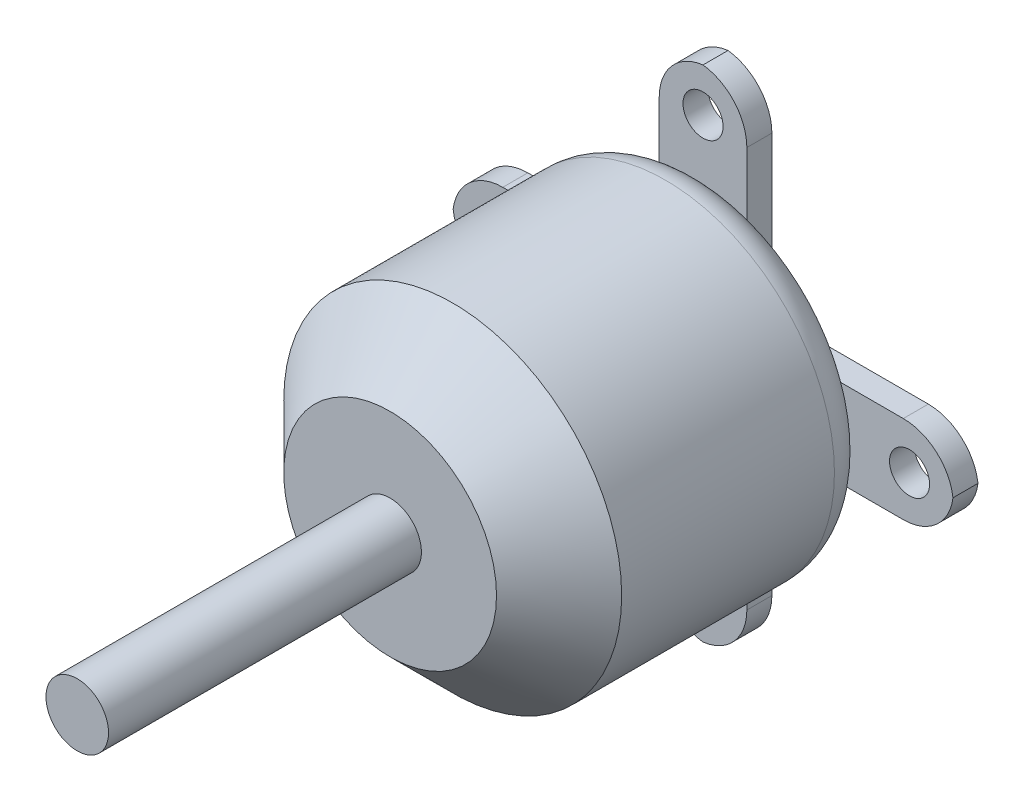
ISO-10303-21;
HEADER;
FILE_DESCRIPTION(('STEP AP214'),'2;1');
FILE_NAME('part.step','',(''),(''),'','','');
FILE_SCHEMA(('AUTOMOTIVE_DESIGN { 1 0 10303 214 1 1 1 1 }'));
ENDSEC;
DATA;
#1=APPLICATION_CONTEXT('core data for automotive mechanical design processes');
#2=APPLICATION_PROTOCOL_DEFINITION('international standard','automotive_design',2000,#1);
#3=PRODUCT_CONTEXT('',#1,'mechanical');
#4=PRODUCT('Part','Part','',(#3));
#5=PRODUCT_RELATED_PRODUCT_CATEGORY('part','',(#4));
#6=PRODUCT_DEFINITION_FORMATION('','',#4);
#7=PRODUCT_DEFINITION_CONTEXT('part definition',#1,'design');
#8=PRODUCT_DEFINITION('design','',#6,#7);
#9=PRODUCT_DEFINITION_SHAPE('','',#8);
#10=(LENGTH_UNIT() NAMED_UNIT(*) SI_UNIT(.MILLI.,.METRE.));
#11=(NAMED_UNIT(*) PLANE_ANGLE_UNIT() SI_UNIT($,.RADIAN.));
#12=(NAMED_UNIT(*) SI_UNIT($,.STERADIAN.) SOLID_ANGLE_UNIT());
#13=UNCERTAINTY_MEASURE_WITH_UNIT(LENGTH_MEASURE(1.E-05),#10,'distance_accuracy_value','');
#14=(GEOMETRIC_REPRESENTATION_CONTEXT(3) GLOBAL_UNCERTAINTY_ASSIGNED_CONTEXT((#13)) GLOBAL_UNIT_ASSIGNED_CONTEXT((#10,
#11,#12)) REPRESENTATION_CONTEXT('',''));
#15=CARTESIAN_POINT('',(0.,0.,0.));
#16=DIRECTION('',(0.,0.,1.));
#17=DIRECTION('',(1.,0.,0.));
#18=AXIS2_PLACEMENT_3D('',#15,#16,#17);
#19=CARTESIAN_POINT('',(0.,0.,0.));
#20=DIRECTION('',(0.,0.,1.));
#21=DIRECTION('',(1.,0.,0.));
#22=AXIS2_PLACEMENT_3D('',#19,#20,#21);
#23=PLANE('',#22);
#24=DIRECTION('',(0.,-1.,0.));
#25=VECTOR('',#24,1.);
#26=CARTESIAN_POINT('',(3.5,16.,0.));
#27=LINE('',#26,#25);
#28=CARTESIAN_POINT('',(3.5,9.89949493661167,0.));
#29=VERTEX_POINT('',#28);
#30=CARTESIAN_POINT('',(3.5,7.5,0.));
#31=VERTEX_POINT('',#30);
#32=EDGE_CURVE('E305',#29,#31,#27,.T.);
#33=ORIENTED_EDGE('',*,*,#32,.F.);
#34=CARTESIAN_POINT('',(0.,0.,0.));
#35=DIRECTION('',(0.,0.,1.));
#36=DIRECTION('',(1.,0.,0.));
#37=AXIS2_PLACEMENT_3D('',#34,#35,#36);
#38=CIRCLE('',#37,10.5);
#39=CARTESIAN_POINT('',(9.89949493661166,3.5,0.));
#40=VERTEX_POINT('',#39);
#41=EDGE_CURVE('E818',#29,#40,#38,.F.);
#42=ORIENTED_EDGE('',*,*,#41,.T.);
#43=DIRECTION('',(1.,0.,0.));
#44=VECTOR('',#43,1.);
#45=CARTESIAN_POINT('',(16.,3.5,0.));
#46=LINE('',#45,#44);
#47=CARTESIAN_POINT('',(7.5,3.5,0.));
#48=VERTEX_POINT('',#47);
#49=EDGE_CURVE('E55',#48,#40,#46,.T.);
#50=ORIENTED_EDGE('',*,*,#49,.F.);
#51=CARTESIAN_POINT('',(7.5,7.5,0.));
#52=DIRECTION('',(0.,0.,1.));
#53=DIRECTION('',(1.,0.,0.));
#54=AXIS2_PLACEMENT_3D('',#51,#52,#53);
#55=CIRCLE('',#54,4.);
#56=EDGE_CURVE('E50',#31,#48,#55,.T.);
#57=ORIENTED_EDGE('',*,*,#56,.F.);
#58=EDGE_LOOP('',(#33,#42,#50,#57));
#59=FACE_BOUND('',#58,.T.);
#60=ADVANCED_FACE('F34',(#59),#23,.F.);
#61=DIRECTION('',(-1.,0.,0.));
#62=VECTOR('',#61,1.);
#63=CARTESIAN_POINT('',(16.,-3.5,0.));
#64=LINE('',#63,#62);
#65=CARTESIAN_POINT('',(9.89949493661044,-3.5,0.));
#66=VERTEX_POINT('',#65);
#67=CARTESIAN_POINT('',(7.5,-3.5,0.));
#68=VERTEX_POINT('',#67);
#69=EDGE_CURVE('E320',#66,#68,#64,.T.);
#70=ORIENTED_EDGE('',*,*,#69,.F.);
#71=CARTESIAN_POINT('',(3.5,-9.89949493661166,0.));
#72=VERTEX_POINT('',#71);
#73=EDGE_CURVE('E241',#66,#72,#38,.F.);
#74=ORIENTED_EDGE('',*,*,#73,.T.);
#75=DIRECTION('',(0.,-1.,0.));
#76=VECTOR('',#75,1.);
#77=CARTESIAN_POINT('',(3.5,-7.5,0.));
#78=LINE('',#77,#76);
#79=CARTESIAN_POINT('',(3.5,-7.5,0.));
#80=VERTEX_POINT('',#79);
#81=EDGE_CURVE('E329',#80,#72,#78,.T.);
#82=ORIENTED_EDGE('',*,*,#81,.F.);
#83=CARTESIAN_POINT('',(7.5,-7.5,0.));
#84=DIRECTION('',(0.,0.,1.));
#85=DIRECTION('',(-1.,0.,0.));
#86=AXIS2_PLACEMENT_3D('',#83,#84,#85);
#87=CIRCLE('',#86,4.);
#88=EDGE_CURVE('E324',#68,#80,#87,.T.);
#89=ORIENTED_EDGE('',*,*,#88,.F.);
#90=EDGE_LOOP('',(#70,#74,#82,#89));
#91=FACE_BOUND('',#90,.T.);
#92=ADVANCED_FACE('F269',(#91),#23,.F.);
#93=DIRECTION('',(0.,1.,0.));
#94=VECTOR('',#93,1.);
#95=CARTESIAN_POINT('',(-3.5,-7.5,0.));
#96=LINE('',#95,#94);
#97=CARTESIAN_POINT('',(-3.5,-9.89949493661166,0.));
#98=VERTEX_POINT('',#97);
#99=CARTESIAN_POINT('',(-3.5,-7.5,0.));
#100=VERTEX_POINT('',#99);
#101=EDGE_CURVE('E338',#98,#100,#96,.T.);
#102=ORIENTED_EDGE('',*,*,#101,.F.);
#103=CARTESIAN_POINT('',(-9.89949493661167,-3.5,0.));
#104=VERTEX_POINT('',#103);
#105=EDGE_CURVE('E821',#98,#104,#38,.F.);
#106=ORIENTED_EDGE('',*,*,#105,.T.);
#107=DIRECTION('',(-1.,0.,0.));
#108=VECTOR('',#107,1.);
#109=CARTESIAN_POINT('',(-7.5,-3.5,0.));
#110=LINE('',#109,#108);
#111=CARTESIAN_POINT('',(-7.5,-3.5,0.));
#112=VERTEX_POINT('',#111);
#113=EDGE_CURVE('E347',#112,#104,#110,.T.);
#114=ORIENTED_EDGE('',*,*,#113,.F.);
#115=CARTESIAN_POINT('',(-7.5,-7.5,0.));
#116=DIRECTION('',(0.,0.,1.));
#117=DIRECTION('',(1.,0.,0.));
#118=AXIS2_PLACEMENT_3D('',#115,#116,#117);
#119=CIRCLE('',#118,4.);
#120=EDGE_CURVE('E343',#100,#112,#119,.T.);
#121=ORIENTED_EDGE('',*,*,#120,.F.);
#122=EDGE_LOOP('',(#102,#106,#114,#121));
#123=FACE_BOUND('',#122,.T.);
#124=ADVANCED_FACE('F275',(#123),#23,.F.);
#125=DIRECTION('',(0.,1.,0.));
#126=VECTOR('',#125,1.);
#127=CARTESIAN_POINT('',(-3.5,16.,0.));
#128=LINE('',#127,#126);
#129=CARTESIAN_POINT('',(-3.5,7.5,0.));
#130=VERTEX_POINT('',#129);
#131=CARTESIAN_POINT('',(-3.5,9.89949493661167,0.));
#132=VERTEX_POINT('',#131);
#133=EDGE_CURVE('E289',#130,#132,#128,.T.);
#134=ORIENTED_EDGE('',*,*,#133,.F.);
#135=CARTESIAN_POINT('',(-7.5,7.5,0.));
#136=DIRECTION('',(0.,0.,1.));
#137=DIRECTION('',(-1.,0.,0.));
#138=AXIS2_PLACEMENT_3D('',#135,#136,#137);
#139=CIRCLE('',#138,4.);
#140=CARTESIAN_POINT('',(-7.5,3.5,0.));
#141=VERTEX_POINT('',#140);
#142=EDGE_CURVE('E222',#141,#130,#139,.T.);
#143=ORIENTED_EDGE('',*,*,#142,.F.);
#144=DIRECTION('',(1.,0.,0.));
#145=VECTOR('',#144,1.);
#146=CARTESIAN_POINT('',(-7.5,3.5,0.));
#147=LINE('',#146,#145);
#148=CARTESIAN_POINT('',(-9.89949493661167,3.5,0.));
#149=VERTEX_POINT('',#148);
#150=EDGE_CURVE('E355',#149,#141,#147,.T.);
#151=ORIENTED_EDGE('',*,*,#150,.F.);
#152=EDGE_CURVE('E292',#149,#132,#38,.F.);
#153=ORIENTED_EDGE('',*,*,#152,.T.);
#154=EDGE_LOOP('',(#134,#143,#151,#153));
#155=FACE_BOUND('',#154,.T.);
#156=ADVANCED_FACE('F271',(#155),#23,.F.);
#157=CARTESIAN_POINT('',(0.,0.,25.));
#158=DIRECTION('',(0.,0.,-1.));
#159=DIRECTION('',(-1.,0.,0.));
#160=AXIS2_PLACEMENT_3D('',#157,#158,#159);
#161=CYLINDRICAL_SURFACE('',#160,13.5);
#162=CARTESIAN_POINT('',(0.,0.,20.));
#163=DIRECTION('',(0.,0.,1.));
#164=DIRECTION('',(1.,0.,0.));
#165=AXIS2_PLACEMENT_3D('',#162,#163,#164);
#166=CIRCLE('',#165,13.5);
#167=CARTESIAN_POINT('',(13.5,0.,20.));
#168=VERTEX_POINT('',#167);
#169=EDGE_CURVE('E11',#168,#168,#166,.F.);
#170=ORIENTED_EDGE('',*,*,#169,.T.);
#171=EDGE_LOOP('',(#170));
#172=FACE_BOUND('',#171,.T.);
#173=CARTESIAN_POINT('',(0.,0.,3.));
#174=DIRECTION('',(0.,0.,1.));
#175=DIRECTION('',(1.,0.,0.));
#176=AXIS2_PLACEMENT_3D('',#173,#174,#175);
#177=CIRCLE('',#176,13.5);
#178=CARTESIAN_POINT('',(13.5,0.,3.));
#179=VERTEX_POINT('',#178);
#180=EDGE_CURVE('E235',#179,#179,#177,.T.);
#181=ORIENTED_EDGE('',*,*,#180,.T.);
#182=EDGE_LOOP('',(#181));
#183=FACE_BOUND('',#182,.T.);
#184=ADVANCED_FACE('F280',(#172,#183),#161,.T.);
#185=CARTESIAN_POINT('',(0.,0.,25.));
#186=DIRECTION('',(0.,0.,1.));
#187=DIRECTION('',(1.,0.,0.));
#188=AXIS2_PLACEMENT_3D('',#185,#186,#187);
#189=PLANE('',#188);
#190=CARTESIAN_POINT('',(0.,0.,25.));
#191=DIRECTION('',(0.,0.,1.));
#192=DIRECTION('',(1.,0.,0.));
#193=AXIS2_PLACEMENT_3D('',#190,#191,#192);
#194=CIRCLE('',#193,8.49999999999999);
#195=CARTESIAN_POINT('',(8.49999999999999,0.,25.));
#196=VERTEX_POINT('',#195);
#197=EDGE_CURVE('E43',#196,#196,#194,.T.);
#198=ORIENTED_EDGE('',*,*,#197,.T.);
#199=EDGE_LOOP('',(#198));
#200=FACE_BOUND('',#199,.T.);
#201=CARTESIAN_POINT('',(0.,0.,25.));
#202=DIRECTION('',(0.,0.,1.));
#203=DIRECTION('',(1.,0.,0.));
#204=AXIS2_PLACEMENT_3D('',#201,#202,#203);
#205=CIRCLE('',#204,2.5);
#206=CARTESIAN_POINT('',(2.5,0.,25.));
#207=VERTEX_POINT('',#206);
#208=EDGE_CURVE('E223',#207,#207,#205,.T.);
#209=ORIENTED_EDGE('',*,*,#208,.F.);
#210=EDGE_LOOP('',(#209));
#211=FACE_BOUND('',#210,.T.);
#212=ADVANCED_FACE('F250',(#200,#211),#189,.T.);
#213=CARTESIAN_POINT('',(0.,0.,50.));
#214=DIRECTION('',(0.,0.,-1.));
#215=DIRECTION('',(-1.,0.,0.));
#216=AXIS2_PLACEMENT_3D('',#213,#214,#215);
#217=CYLINDRICAL_SURFACE('',#216,2.5);
#218=CARTESIAN_POINT('',(0.,0.,50.));
#219=DIRECTION('',(0.,0.,1.));
#220=DIRECTION('',(1.,0.,0.));
#221=AXIS2_PLACEMENT_3D('',#218,#219,#220);
#222=CIRCLE('',#221,2.5);
#223=CARTESIAN_POINT('',(2.5,0.,50.));
#224=VERTEX_POINT('',#223);
#225=EDGE_CURVE('E227',#224,#224,#222,.T.);
#226=ORIENTED_EDGE('',*,*,#225,.F.);
#227=EDGE_LOOP('',(#226));
#228=FACE_BOUND('',#227,.T.);
#229=ORIENTED_EDGE('',*,*,#208,.T.);
#230=EDGE_LOOP('',(#229));
#231=FACE_BOUND('',#230,.T.);
#232=ADVANCED_FACE('F636',(#228,#231),#217,.T.);
#233=CARTESIAN_POINT('',(0.,0.,50.));
#234=DIRECTION('',(0.,0.,1.));
#235=DIRECTION('',(1.,0.,0.));
#236=AXIS2_PLACEMENT_3D('',#233,#234,#235);
#237=PLANE('',#236);
#238=ORIENTED_EDGE('',*,*,#225,.T.);
#239=EDGE_LOOP('',(#238));
#240=FACE_BOUND('',#239,.T.);
#241=ADVANCED_FACE('F265',(#240),#237,.T.);
#242=CARTESIAN_POINT('',(0.,0.,3.));
#243=DIRECTION('',(0.,0.,1.));
#244=DIRECTION('',(1.,0.,0.));
#245=AXIS2_PLACEMENT_3D('',#242,#243,#244);
#246=TOROIDAL_SURFACE('',#245,10.5,3.);
#247=ORIENTED_EDGE('',*,*,#73,.F.);
#248=EDGE_CURVE('E240',#40,#66,#38,.F.);
#249=ORIENTED_EDGE('',*,*,#248,.F.);
#250=ORIENTED_EDGE('',*,*,#41,.F.);
#251=EDGE_CURVE('E426',#132,#29,#38,.F.);
#252=ORIENTED_EDGE('',*,*,#251,.F.);
#253=ORIENTED_EDGE('',*,*,#152,.F.);
#254=EDGE_CURVE('E819',#104,#149,#38,.F.);
#255=ORIENTED_EDGE('',*,*,#254,.F.);
#256=ORIENTED_EDGE('',*,*,#105,.F.);
#257=EDGE_CURVE('E243',#72,#98,#38,.F.);
#258=ORIENTED_EDGE('',*,*,#257,.F.);
#259=EDGE_LOOP('',(#247,#249,#250,#252,#253,#255,#256,#258));
#260=FACE_BOUND('',#259,.T.);
#261=ORIENTED_EDGE('',*,*,#180,.F.);
#262=EDGE_LOOP('',(#261));
#263=FACE_BOUND('',#262,.T.);
#264=ADVANCED_FACE('F255',(#260,#263),#246,.T.);
#265=CARTESIAN_POINT('',(0.,0.,25.));
#266=DIRECTION('',(0.,0.,-1.));
#267=DIRECTION('',(-1.,0.,0.));
#268=AXIS2_PLACEMENT_3D('',#265,#266,#267);
#269=CONICAL_SURFACE('',#268,8.49999999999999,0.785398163397447);
#270=ORIENTED_EDGE('',*,*,#169,.F.);
#271=EDGE_LOOP('',(#270));
#272=FACE_BOUND('',#271,.T.);
#273=ORIENTED_EDGE('',*,*,#197,.F.);
#274=EDGE_LOOP('',(#273));
#275=FACE_BOUND('',#274,.T.);
#276=ADVANCED_FACE('F36',(#272,#275),#269,.T.);
#277=CARTESIAN_POINT('',(-7.5,7.5,0.));
#278=DIRECTION('',(0.,0.,-1.));
#279=DIRECTION('',(-1.,0.,0.));
#280=AXIS2_PLACEMENT_3D('',#277,#278,#279);
#281=PLANE('',#280);
#282=CARTESIAN_POINT('',(1.72828326272735E-13,-16.5,0.));
#283=DIRECTION('',(0.,0.,-1.));
#284=DIRECTION('',(-1.,0.,0.));
#285=AXIS2_PLACEMENT_3D('',#282,#283,#284);
#286=CIRCLE('',#285,1.6);
#287=CARTESIAN_POINT('',(-1.59999999999983,-16.5,0.));
#288=VERTEX_POINT('',#287);
#289=EDGE_CURVE('E546',#288,#288,#286,.T.);
#290=ORIENTED_EDGE('',*,*,#289,.T.);
#291=EDGE_LOOP('',(#290));
#292=FACE_BOUND('',#291,.T.);
#293=CARTESIAN_POINT('',(3.5,-16.,0.));
#294=VERTEX_POINT('',#293);
#295=EDGE_CURVE('E328',#72,#294,#78,.T.);
#296=ORIENTED_EDGE('',*,*,#295,.F.);
#297=ORIENTED_EDGE('',*,*,#257,.T.);
#298=CARTESIAN_POINT('',(-3.5,-16.,0.));
#299=VERTEX_POINT('',#298);
#300=EDGE_CURVE('E339',#299,#98,#96,.T.);
#301=ORIENTED_EDGE('',*,*,#300,.F.);
#302=CARTESIAN_POINT('',(0.499999999999999,-16.,0.));
#303=DIRECTION('',(0.,0.,-1.));
#304=DIRECTION('',(-1.,0.,0.));
#305=AXIS2_PLACEMENT_3D('',#302,#303,#304);
#306=CIRCLE('',#305,4.);
#307=CARTESIAN_POINT('',(0.,-19.9686269665969,0.));
#308=VERTEX_POINT('',#307);
#309=EDGE_CURVE('E335',#308,#299,#306,.T.);
#310=ORIENTED_EDGE('',*,*,#309,.F.);
#311=CARTESIAN_POINT('',(-0.500000000000002,-16.,0.));
#312=DIRECTION('',(0.,0.,-1.));
#313=DIRECTION('',(-1.,0.,0.));
#314=AXIS2_PLACEMENT_3D('',#311,#312,#313);
#315=CIRCLE('',#314,4.);
#316=EDGE_CURVE('E332',#294,#308,#315,.T.);
#317=ORIENTED_EDGE('',*,*,#316,.F.);
#318=EDGE_LOOP('',(#296,#297,#301,#310,#317));
#319=FACE_BOUND('',#318,.T.);
#320=ADVANCED_FACE('F254',(#292,#319),#281,.F.);
#321=CARTESIAN_POINT('',(-16.5,-1.15218884181823E-13,0.));
#322=DIRECTION('',(0.,0.,-1.));
#323=DIRECTION('',(-1.,0.,0.));
#324=AXIS2_PLACEMENT_3D('',#321,#322,#323);
#325=CIRCLE('',#324,1.6);
#326=CARTESIAN_POINT('',(-18.1,-1.15218884181823E-13,0.));
#327=VERTEX_POINT('',#326);
#328=EDGE_CURVE('E498',#327,#327,#325,.T.);
#329=ORIENTED_EDGE('',*,*,#328,.T.);
#330=EDGE_LOOP('',(#329));
#331=FACE_BOUND('',#330,.T.);
#332=CARTESIAN_POINT('',(-16.,-3.5,0.));
#333=VERTEX_POINT('',#332);
#334=EDGE_CURVE('E346',#104,#333,#110,.T.);
#335=ORIENTED_EDGE('',*,*,#334,.F.);
#336=ORIENTED_EDGE('',*,*,#254,.T.);
#337=CARTESIAN_POINT('',(-16.,3.5,0.));
#338=VERTEX_POINT('',#337);
#339=EDGE_CURVE('E219',#338,#149,#147,.T.);
#340=ORIENTED_EDGE('',*,*,#339,.F.);
#341=CARTESIAN_POINT('',(-16.,-0.5,0.));
#342=DIRECTION('',(0.,0.,-1.));
#343=DIRECTION('',(1.,0.,0.));
#344=AXIS2_PLACEMENT_3D('',#341,#342,#343);
#345=CIRCLE('',#344,4.);
#346=CARTESIAN_POINT('',(-19.9686269665969,0.,0.));
#347=VERTEX_POINT('',#346);
#348=EDGE_CURVE('E353',#347,#338,#345,.T.);
#349=ORIENTED_EDGE('',*,*,#348,.F.);
#350=CARTESIAN_POINT('',(-16.,0.5,0.));
#351=DIRECTION('',(0.,0.,-1.));
#352=DIRECTION('',(-1.,0.,0.));
#353=AXIS2_PLACEMENT_3D('',#350,#351,#352);
#354=CIRCLE('',#353,4.);
#355=EDGE_CURVE('E350',#333,#347,#354,.T.);
#356=ORIENTED_EDGE('',*,*,#355,.F.);
#357=EDGE_LOOP('',(#335,#336,#340,#349,#356));
#358=FACE_BOUND('',#357,.T.);
#359=ADVANCED_FACE('F261',(#331,#358),#281,.F.);
#360=CARTESIAN_POINT('',(0.,16.5,0.));
#361=DIRECTION('',(0.,0.,-1.));
#362=DIRECTION('',(-1.,0.,0.));
#363=AXIS2_PLACEMENT_3D('',#360,#361,#362);
#364=CIRCLE('',#363,1.6);
#365=CARTESIAN_POINT('',(-1.60000000000006,16.5,0.));
#366=VERTEX_POINT('',#365);
#367=EDGE_CURVE('E529',#366,#366,#364,.T.);
#368=ORIENTED_EDGE('',*,*,#367,.T.);
#369=EDGE_LOOP('',(#368));
#370=FACE_BOUND('',#369,.T.);
#371=CARTESIAN_POINT('',(-3.5,16.,0.));
#372=VERTEX_POINT('',#371);
#373=EDGE_CURVE('E295',#132,#372,#128,.T.);
#374=ORIENTED_EDGE('',*,*,#373,.F.);
#375=ORIENTED_EDGE('',*,*,#251,.T.);
#376=CARTESIAN_POINT('',(3.5,16.,0.));
#377=VERTEX_POINT('',#376);
#378=EDGE_CURVE('E306',#377,#29,#27,.T.);
#379=ORIENTED_EDGE('',*,*,#378,.F.);
#380=CARTESIAN_POINT('',(-0.499999999999998,16.,0.));
#381=DIRECTION('',(0.,0.,-1.));
#382=DIRECTION('',(-1.,0.,0.));
#383=AXIS2_PLACEMENT_3D('',#380,#381,#382);
#384=CIRCLE('',#383,4.);
#385=CARTESIAN_POINT('',(0.,19.9686269665969,0.));
#386=VERTEX_POINT('',#385);
#387=EDGE_CURVE('E297',#386,#377,#384,.T.);
#388=ORIENTED_EDGE('',*,*,#387,.F.);
#389=CARTESIAN_POINT('',(0.500000000000002,16.,0.));
#390=DIRECTION('',(0.,0.,-1.));
#391=DIRECTION('',(1.,0.,0.));
#392=AXIS2_PLACEMENT_3D('',#389,#390,#391);
#393=CIRCLE('',#392,4.);
#394=EDGE_CURVE('E294',#372,#386,#393,.T.);
#395=ORIENTED_EDGE('',*,*,#394,.F.);
#396=EDGE_LOOP('',(#374,#375,#379,#388,#395));
#397=FACE_BOUND('',#396,.T.);
#398=ADVANCED_FACE('F424',(#370,#397),#281,.F.);
#399=CARTESIAN_POINT('',(-7.5,7.5,-2.));
#400=DIRECTION('',(0.,0.,-1.));
#401=DIRECTION('',(-1.,0.,0.));
#402=AXIS2_PLACEMENT_3D('',#399,#400,#401);
#403=PLANE('',#402);
#404=CARTESIAN_POINT('',(0.,0.,-2.));
#405=DIRECTION('',(0.,0.,-1.));
#406=DIRECTION('',(-1.,0.,0.));
#407=AXIS2_PLACEMENT_3D('',#404,#405,#406);
#408=CIRCLE('',#407,4.);
#409=CARTESIAN_POINT('',(-4.,0.,-2.));
#410=VERTEX_POINT('',#409);
#411=EDGE_CURVE('E547',#410,#410,#408,.T.);
#412=ORIENTED_EDGE('',*,*,#411,.F.);
#413=EDGE_LOOP('',(#412));
#414=FACE_BOUND('',#413,.T.);
#415=CARTESIAN_POINT('',(-16.5,-1.15218884181823E-13,-2.));
#416=DIRECTION('',(0.,0.,-1.));
#417=DIRECTION('',(-1.,0.,0.));
#418=AXIS2_PLACEMENT_3D('',#415,#416,#417);
#419=CIRCLE('',#418,1.6);
#420=CARTESIAN_POINT('',(-18.1,-1.15218884181823E-13,-2.));
#421=VERTEX_POINT('',#420);
#422=EDGE_CURVE('E501',#421,#421,#419,.T.);
#423=ORIENTED_EDGE('',*,*,#422,.F.);
#424=EDGE_LOOP('',(#423));
#425=FACE_BOUND('',#424,.T.);
#426=CARTESIAN_POINT('',(16.5,0.,-2.));
#427=DIRECTION('',(0.,0.,-1.));
#428=DIRECTION('',(-1.,0.,0.));
#429=AXIS2_PLACEMENT_3D('',#426,#427,#428);
#430=CIRCLE('',#429,1.6);
#431=CARTESIAN_POINT('',(14.9,0.,-2.));
#432=VERTEX_POINT('',#431);
#433=EDGE_CURVE('E550',#432,#432,#430,.T.);
#434=ORIENTED_EDGE('',*,*,#433,.F.);
#435=EDGE_LOOP('',(#434));
#436=FACE_BOUND('',#435,.T.);
#437=CARTESIAN_POINT('',(-7.5,7.5,-2.));
#438=DIRECTION('',(0.,0.,1.));
#439=DIRECTION('',(-1.,0.,0.));
#440=AXIS2_PLACEMENT_3D('',#437,#438,#439);
#441=CIRCLE('',#440,4.);
#442=CARTESIAN_POINT('',(-7.5,3.5,-2.));
#443=VERTEX_POINT('',#442);
#444=CARTESIAN_POINT('',(-3.5,7.5,-2.));
#445=VERTEX_POINT('',#444);
#446=EDGE_CURVE('E208',#443,#445,#441,.T.);
#447=ORIENTED_EDGE('',*,*,#446,.T.);
#448=DIRECTION('',(0.,1.,0.));
#449=VECTOR('',#448,1.);
#450=CARTESIAN_POINT('',(-3.5,16.,-2.));
#451=LINE('',#450,#449);
#452=CARTESIAN_POINT('',(-3.5,16.,-2.));
#453=VERTEX_POINT('',#452);
#454=EDGE_CURVE('E195',#445,#453,#451,.T.);
#455=ORIENTED_EDGE('',*,*,#454,.T.);
#456=CARTESIAN_POINT('',(0.500000000000002,16.,-2.));
#457=DIRECTION('',(0.,0.,-1.));
#458=DIRECTION('',(1.,0.,0.));
#459=AXIS2_PLACEMENT_3D('',#456,#457,#458);
#460=CIRCLE('',#459,4.);
#461=CARTESIAN_POINT('',(0.,19.9686269665969,-2.));
#462=VERTEX_POINT('',#461);
#463=EDGE_CURVE('E207',#453,#462,#460,.T.);
#464=ORIENTED_EDGE('',*,*,#463,.T.);
#465=CARTESIAN_POINT('',(-0.499999999999998,16.,-2.));
#466=DIRECTION('',(0.,0.,-1.));
#467=DIRECTION('',(-1.,0.,0.));
#468=AXIS2_PLACEMENT_3D('',#465,#466,#467);
#469=CIRCLE('',#468,4.);
#470=CARTESIAN_POINT('',(3.5,16.,-2.));
#471=VERTEX_POINT('',#470);
#472=EDGE_CURVE('E419',#462,#471,#469,.T.);
#473=ORIENTED_EDGE('',*,*,#472,.T.);
#474=DIRECTION('',(0.,-1.,0.));
#475=VECTOR('',#474,1.);
#476=CARTESIAN_POINT('',(3.5,16.,-2.));
#477=LINE('',#476,#475);
#478=CARTESIAN_POINT('',(3.5,7.5,-2.));
#479=VERTEX_POINT('',#478);
#480=EDGE_CURVE('E431',#471,#479,#477,.T.);
#481=ORIENTED_EDGE('',*,*,#480,.T.);
#482=CARTESIAN_POINT('',(7.5,7.5,-2.));
#483=DIRECTION('',(0.,0.,1.));
#484=DIRECTION('',(1.,0.,0.));
#485=AXIS2_PLACEMENT_3D('',#482,#483,#484);
#486=CIRCLE('',#485,4.);
#487=CARTESIAN_POINT('',(7.5,3.5,-2.));
#488=VERTEX_POINT('',#487);
#489=EDGE_CURVE('E434',#479,#488,#486,.T.);
#490=ORIENTED_EDGE('',*,*,#489,.T.);
#491=DIRECTION('',(1.,0.,0.));
#492=VECTOR('',#491,1.);
#493=CARTESIAN_POINT('',(16.,3.5,-2.));
#494=LINE('',#493,#492);
#495=CARTESIAN_POINT('',(16.,3.5,-2.));
#496=VERTEX_POINT('',#495);
#497=EDGE_CURVE('E439',#488,#496,#494,.T.);
#498=ORIENTED_EDGE('',*,*,#497,.T.);
#499=CARTESIAN_POINT('',(16.,-0.5,-2.));
#500=DIRECTION('',(0.,0.,-1.));
#501=DIRECTION('',(-1.,0.,0.));
#502=AXIS2_PLACEMENT_3D('',#499,#500,#501);
#503=CIRCLE('',#502,4.);
#504=CARTESIAN_POINT('',(19.9686269665969,0.,-2.));
#505=VERTEX_POINT('',#504);
#506=EDGE_CURVE('E446',#496,#505,#503,.T.);
#507=ORIENTED_EDGE('',*,*,#506,.T.);
#508=CARTESIAN_POINT('',(16.,0.5,-2.));
#509=DIRECTION('',(0.,0.,-1.));
#510=DIRECTION('',(-1.,0.,0.));
#511=AXIS2_PLACEMENT_3D('',#508,#509,#510);
#512=CIRCLE('',#511,4.);
#513=CARTESIAN_POINT('',(16.,-3.5,-2.));
#514=VERTEX_POINT('',#513);
#515=EDGE_CURVE('E449',#505,#514,#512,.T.);
#516=ORIENTED_EDGE('',*,*,#515,.T.);
#517=DIRECTION('',(-1.,0.,0.));
#518=VECTOR('',#517,1.);
#519=CARTESIAN_POINT('',(16.,-3.5,-2.));
#520=LINE('',#519,#518);
#521=CARTESIAN_POINT('',(7.5,-3.5,-2.));
#522=VERTEX_POINT('',#521);
#523=EDGE_CURVE('E451',#514,#522,#520,.T.);
#524=ORIENTED_EDGE('',*,*,#523,.T.);
#525=CARTESIAN_POINT('',(7.5,-7.5,-2.));
#526=DIRECTION('',(0.,0.,1.));
#527=DIRECTION('',(-1.,0.,0.));
#528=AXIS2_PLACEMENT_3D('',#525,#526,#527);
#529=CIRCLE('',#528,4.);
#530=CARTESIAN_POINT('',(3.5,-7.5,-2.));
#531=VERTEX_POINT('',#530);
#532=EDGE_CURVE('E453',#522,#531,#529,.T.);
#533=ORIENTED_EDGE('',*,*,#532,.T.);
#534=DIRECTION('',(0.,-1.,0.));
#535=VECTOR('',#534,1.);
#536=CARTESIAN_POINT('',(3.5,-7.5,-2.));
#537=LINE('',#536,#535);
#538=CARTESIAN_POINT('',(3.5,-16.,-2.));
#539=VERTEX_POINT('',#538);
#540=EDGE_CURVE('E456',#531,#539,#537,.T.);
#541=ORIENTED_EDGE('',*,*,#540,.T.);
#542=CARTESIAN_POINT('',(-0.500000000000002,-16.,-2.));
#543=DIRECTION('',(0.,0.,-1.));
#544=DIRECTION('',(-1.,0.,0.));
#545=AXIS2_PLACEMENT_3D('',#542,#543,#544);
#546=CIRCLE('',#545,4.);
#547=CARTESIAN_POINT('',(0.,-19.9686269665969,-2.));
#548=VERTEX_POINT('',#547);
#549=EDGE_CURVE('E459',#539,#548,#546,.T.);
#550=ORIENTED_EDGE('',*,*,#549,.T.);
#551=CARTESIAN_POINT('',(0.499999999999999,-16.,-2.));
#552=DIRECTION('',(0.,0.,-1.));
#553=DIRECTION('',(-1.,0.,0.));
#554=AXIS2_PLACEMENT_3D('',#551,#552,#553);
#555=CIRCLE('',#554,4.);
#556=CARTESIAN_POINT('',(-3.5,-16.,-2.));
#557=VERTEX_POINT('',#556);
#558=EDGE_CURVE('E462',#548,#557,#555,.T.);
#559=ORIENTED_EDGE('',*,*,#558,.T.);
#560=DIRECTION('',(0.,1.,0.));
#561=VECTOR('',#560,1.);
#562=CARTESIAN_POINT('',(-3.5,-7.5,-2.));
#563=LINE('',#562,#561);
#564=CARTESIAN_POINT('',(-3.5,-7.5,-2.));
#565=VERTEX_POINT('',#564);
#566=EDGE_CURVE('E465',#557,#565,#563,.T.);
#567=ORIENTED_EDGE('',*,*,#566,.T.);
#568=CARTESIAN_POINT('',(-7.5,-7.5,-2.));
#569=DIRECTION('',(0.,0.,1.));
#570=DIRECTION('',(1.,0.,0.));
#571=AXIS2_PLACEMENT_3D('',#568,#569,#570);
#572=CIRCLE('',#571,4.);
#573=CARTESIAN_POINT('',(-7.5,-3.5,-2.));
#574=VERTEX_POINT('',#573);
#575=EDGE_CURVE('E467',#565,#574,#572,.T.);
#576=ORIENTED_EDGE('',*,*,#575,.T.);
#577=DIRECTION('',(-1.,0.,0.));
#578=VECTOR('',#577,1.);
#579=CARTESIAN_POINT('',(-7.5,-3.5,-2.));
#580=LINE('',#579,#578);
#581=CARTESIAN_POINT('',(-16.,-3.5,-2.));
#582=VERTEX_POINT('',#581);
#583=EDGE_CURVE('E469',#574,#582,#580,.T.);
#584=ORIENTED_EDGE('',*,*,#583,.T.);
#585=CARTESIAN_POINT('',(-16.,0.5,-2.));
#586=DIRECTION('',(0.,0.,-1.));
#587=DIRECTION('',(-1.,0.,0.));
#588=AXIS2_PLACEMENT_3D('',#585,#586,#587);
#589=CIRCLE('',#588,4.);
#590=CARTESIAN_POINT('',(-19.9686269665969,0.,-2.));
#591=VERTEX_POINT('',#590);
#592=EDGE_CURVE('E472',#582,#591,#589,.T.);
#593=ORIENTED_EDGE('',*,*,#592,.T.);
#594=CARTESIAN_POINT('',(-16.,-0.5,-2.));
#595=DIRECTION('',(0.,0.,-1.));
#596=DIRECTION('',(1.,0.,0.));
#597=AXIS2_PLACEMENT_3D('',#594,#595,#596);
#598=CIRCLE('',#597,4.);
#599=CARTESIAN_POINT('',(-16.,3.5,-2.));
#600=VERTEX_POINT('',#599);
#601=EDGE_CURVE('E475',#591,#600,#598,.T.);
#602=ORIENTED_EDGE('',*,*,#601,.T.);
#603=DIRECTION('',(1.,0.,0.));
#604=VECTOR('',#603,1.);
#605=CARTESIAN_POINT('',(-7.5,3.5,-2.));
#606=LINE('',#605,#604);
#607=EDGE_CURVE('E214',#600,#443,#606,.T.);
#608=ORIENTED_EDGE('',*,*,#607,.T.);
#609=EDGE_LOOP('',(#447,#455,#464,#473,#481,#490,#498,#507,#516,#524,#533,#541,#550,#559,#567,
#576,#584,#593,#602,#608));
#610=FACE_BOUND('',#609,.T.);
#611=CARTESIAN_POINT('',(0.,16.5,-2.));
#612=DIRECTION('',(0.,0.,-1.));
#613=DIRECTION('',(-1.,0.,0.));
#614=AXIS2_PLACEMENT_3D('',#611,#612,#613);
#615=CIRCLE('',#614,1.6);
#616=CARTESIAN_POINT('',(-1.60000000000006,16.5,-2.));
#617=VERTEX_POINT('',#616);
#618=EDGE_CURVE('E524',#617,#617,#615,.T.);
#619=ORIENTED_EDGE('',*,*,#618,.F.);
#620=EDGE_LOOP('',(#619));
#621=FACE_BOUND('',#620,.T.);
#622=CARTESIAN_POINT('',(1.72828326272735E-13,-16.5,-2.));
#623=DIRECTION('',(0.,0.,-1.));
#624=DIRECTION('',(-1.,0.,0.));
#625=AXIS2_PLACEMENT_3D('',#622,#623,#624);
#626=CIRCLE('',#625,1.6);
#627=CARTESIAN_POINT('',(-1.59999999999983,-16.5,-2.));
#628=VERTEX_POINT('',#627);
#629=EDGE_CURVE('E502',#628,#628,#626,.T.);
#630=ORIENTED_EDGE('',*,*,#629,.F.);
#631=EDGE_LOOP('',(#630));
#632=FACE_BOUND('',#631,.T.);
#633=ADVANCED_FACE('F211',(#414,#425,#436,#610,#621,#632),#403,.T.);
#634=CARTESIAN_POINT('',(16.,3.5,0.));
#635=VERTEX_POINT('',#634);
#636=EDGE_CURVE('E312',#40,#635,#46,.T.);
#637=ORIENTED_EDGE('',*,*,#636,.F.);
#638=ORIENTED_EDGE('',*,*,#248,.T.);
#639=CARTESIAN_POINT('',(16.,-3.5,0.));
#640=VERTEX_POINT('',#639);
#641=EDGE_CURVE('E321',#640,#66,#64,.T.);
#642=ORIENTED_EDGE('',*,*,#641,.F.);
#643=CARTESIAN_POINT('',(16.,0.5,0.));
#644=DIRECTION('',(0.,0.,-1.));
#645=DIRECTION('',(-1.,0.,0.));
#646=AXIS2_PLACEMENT_3D('',#643,#644,#645);
#647=CIRCLE('',#646,4.);
#648=CARTESIAN_POINT('',(19.9686269665969,0.,0.));
#649=VERTEX_POINT('',#648);
#650=EDGE_CURVE('E317',#649,#640,#647,.T.);
#651=ORIENTED_EDGE('',*,*,#650,.F.);
#652=CARTESIAN_POINT('',(16.,-0.5,0.));
#653=DIRECTION('',(0.,0.,-1.));
#654=DIRECTION('',(-1.,0.,0.));
#655=AXIS2_PLACEMENT_3D('',#652,#653,#654);
#656=CIRCLE('',#655,4.);
#657=EDGE_CURVE('E314',#635,#649,#656,.T.);
#658=ORIENTED_EDGE('',*,*,#657,.F.);
#659=EDGE_LOOP('',(#637,#638,#642,#651,#658));
#660=FACE_BOUND('',#659,.T.);
#661=CARTESIAN_POINT('',(16.5,0.,0.));
#662=DIRECTION('',(0.,0.,-1.));
#663=DIRECTION('',(-1.,0.,0.));
#664=AXIS2_PLACEMENT_3D('',#661,#662,#663);
#665=CIRCLE('',#664,1.6);
#666=CARTESIAN_POINT('',(14.9,0.,0.));
#667=VERTEX_POINT('',#666);
#668=EDGE_CURVE('E528',#667,#667,#665,.T.);
#669=ORIENTED_EDGE('',*,*,#668,.T.);
#670=EDGE_LOOP('',(#669));
#671=FACE_BOUND('',#670,.T.);
#672=ADVANCED_FACE('F264',(#660,#671),#281,.F.);
#673=CARTESIAN_POINT('',(-7.5,7.5,-2.));
#674=DIRECTION('',(0.,0.,1.));
#675=DIRECTION('',(1.,0.,0.));
#676=AXIS2_PLACEMENT_3D('',#673,#674,#675);
#677=CYLINDRICAL_SURFACE('',#676,4.);
#678=ORIENTED_EDGE('',*,*,#142,.T.);
#679=DIRECTION('',(0.,0.,1.));
#680=VECTOR('',#679,1.);
#681=CARTESIAN_POINT('',(-3.5,7.5,-2.));
#682=LINE('',#681,#680);
#683=EDGE_CURVE('E200',#445,#130,#682,.T.);
#684=ORIENTED_EDGE('',*,*,#683,.F.);
#685=ORIENTED_EDGE('',*,*,#446,.F.);
#686=DIRECTION('',(0.,0.,1.));
#687=VECTOR('',#686,1.);
#688=CARTESIAN_POINT('',(-7.5,3.5,-2.));
#689=LINE('',#688,#687);
#690=EDGE_CURVE('E358',#443,#141,#689,.T.);
#691=ORIENTED_EDGE('',*,*,#690,.T.);
#692=EDGE_LOOP('',(#678,#684,#685,#691));
#693=FACE_BOUND('',#692,.T.);
#694=ADVANCED_FACE('F221',(#693),#677,.F.);
#695=CARTESIAN_POINT('',(-3.5,16.,-2.));
#696=DIRECTION('',(1.,0.,0.));
#697=DIRECTION('',(0.,0.,-1.));
#698=AXIS2_PLACEMENT_3D('',#695,#696,#697);
#699=PLANE('',#698);
#700=ORIENTED_EDGE('',*,*,#133,.T.);
#701=ORIENTED_EDGE('',*,*,#373,.T.);
#702=DIRECTION('',(0.,0.,1.));
#703=VECTOR('',#702,1.);
#704=CARTESIAN_POINT('',(-3.5,16.,-2.));
#705=LINE('',#704,#703);
#706=EDGE_CURVE('E203',#453,#372,#705,.T.);
#707=ORIENTED_EDGE('',*,*,#706,.F.);
#708=ORIENTED_EDGE('',*,*,#454,.F.);
#709=ORIENTED_EDGE('',*,*,#683,.T.);
#710=EDGE_LOOP('',(#700,#701,#707,#708,#709));
#711=FACE_BOUND('',#710,.T.);
#712=ADVANCED_FACE('F198',(#711),#699,.F.);
#713=CARTESIAN_POINT('',(0.500000000000002,16.,-2.));
#714=DIRECTION('',(0.,0.,1.));
#715=DIRECTION('',(1.,0.,0.));
#716=AXIS2_PLACEMENT_3D('',#713,#714,#715);
#717=CYLINDRICAL_SURFACE('',#716,4.);
#718=ORIENTED_EDGE('',*,*,#394,.T.);
#719=DIRECTION('',(0.,0.,1.));
#720=VECTOR('',#719,1.);
#721=CARTESIAN_POINT('',(0.,19.9686269665969,-2.));
#722=LINE('',#721,#720);
#723=EDGE_CURVE('E229',#462,#386,#722,.T.);
#724=ORIENTED_EDGE('',*,*,#723,.F.);
#725=ORIENTED_EDGE('',*,*,#463,.F.);
#726=ORIENTED_EDGE('',*,*,#706,.T.);
#727=EDGE_LOOP('',(#718,#724,#725,#726));
#728=FACE_BOUND('',#727,.T.);
#729=ADVANCED_FACE('F722',(#728),#717,.T.);
#730=CARTESIAN_POINT('',(-0.499999999999998,16.,-2.));
#731=DIRECTION('',(0.,0.,1.));
#732=DIRECTION('',(1.,0.,0.));
#733=AXIS2_PLACEMENT_3D('',#730,#731,#732);
#734=CYLINDRICAL_SURFACE('',#733,4.);
#735=ORIENTED_EDGE('',*,*,#387,.T.);
#736=DIRECTION('',(0.,0.,1.));
#737=VECTOR('',#736,1.);
#738=CARTESIAN_POINT('',(3.5,16.,-2.));
#739=LINE('',#738,#737);
#740=EDGE_CURVE('E409',#471,#377,#739,.T.);
#741=ORIENTED_EDGE('',*,*,#740,.F.);
#742=ORIENTED_EDGE('',*,*,#472,.F.);
#743=ORIENTED_EDGE('',*,*,#723,.T.);
#744=EDGE_LOOP('',(#735,#741,#742,#743));
#745=FACE_BOUND('',#744,.T.);
#746=ADVANCED_FACE('F417',(#745),#734,.T.);
#747=CARTESIAN_POINT('',(3.5,16.,-2.));
#748=DIRECTION('',(-1.,0.,0.));
#749=DIRECTION('',(0.,-1.,0.));
#750=AXIS2_PLACEMENT_3D('',#747,#748,#749);
#751=PLANE('',#750);
#752=ORIENTED_EDGE('',*,*,#378,.T.);
#753=ORIENTED_EDGE('',*,*,#32,.T.);
#754=DIRECTION('',(0.,0.,1.));
#755=VECTOR('',#754,1.);
#756=CARTESIAN_POINT('',(3.5,7.5,-2.));
#757=LINE('',#756,#755);
#758=EDGE_CURVE('E406',#479,#31,#757,.T.);
#759=ORIENTED_EDGE('',*,*,#758,.F.);
#760=ORIENTED_EDGE('',*,*,#480,.F.);
#761=ORIENTED_EDGE('',*,*,#740,.T.);
#762=EDGE_LOOP('',(#752,#753,#759,#760,#761));
#763=FACE_BOUND('',#762,.T.);
#764=ADVANCED_FACE('F428',(#763),#751,.F.);
#765=CARTESIAN_POINT('',(7.5,7.5,-2.));
#766=DIRECTION('',(0.,0.,1.));
#767=DIRECTION('',(1.,0.,0.));
#768=AXIS2_PLACEMENT_3D('',#765,#766,#767);
#769=CYLINDRICAL_SURFACE('',#768,4.);
#770=ORIENTED_EDGE('',*,*,#56,.T.);
#771=DIRECTION('',(0.,0.,1.));
#772=VECTOR('',#771,1.);
#773=CARTESIAN_POINT('',(7.5,3.5,-2.));
#774=LINE('',#773,#772);
#775=EDGE_CURVE('E402',#488,#48,#774,.T.);
#776=ORIENTED_EDGE('',*,*,#775,.F.);
#777=ORIENTED_EDGE('',*,*,#489,.F.);
#778=ORIENTED_EDGE('',*,*,#758,.T.);
#779=EDGE_LOOP('',(#770,#776,#777,#778));
#780=FACE_BOUND('',#779,.T.);
#781=ADVANCED_FACE('F729',(#780),#769,.F.);
#782=CARTESIAN_POINT('',(16.,3.5,-2.));
#783=DIRECTION('',(0.,-1.,0.));
#784=DIRECTION('',(1.,0.,0.));
#785=AXIS2_PLACEMENT_3D('',#782,#783,#784);
#786=PLANE('',#785);
#787=ORIENTED_EDGE('',*,*,#49,.T.);
#788=ORIENTED_EDGE('',*,*,#636,.T.);
#789=DIRECTION('',(0.,0.,1.));
#790=VECTOR('',#789,1.);
#791=CARTESIAN_POINT('',(16.,3.5,-2.));
#792=LINE('',#791,#790);
#793=EDGE_CURVE('E398',#496,#635,#792,.T.);
#794=ORIENTED_EDGE('',*,*,#793,.F.);
#795=ORIENTED_EDGE('',*,*,#497,.F.);
#796=ORIENTED_EDGE('',*,*,#775,.T.);
#797=EDGE_LOOP('',(#787,#788,#794,#795,#796));
#798=FACE_BOUND('',#797,.T.);
#799=ADVANCED_FACE('F732',(#798),#786,.F.);
#800=CARTESIAN_POINT('',(16.,-0.5,-2.));
#801=DIRECTION('',(0.,0.,1.));
#802=DIRECTION('',(1.,0.,0.));
#803=AXIS2_PLACEMENT_3D('',#800,#801,#802);
#804=CYLINDRICAL_SURFACE('',#803,4.);
#805=ORIENTED_EDGE('',*,*,#657,.T.);
#806=DIRECTION('',(0.,0.,1.));
#807=VECTOR('',#806,1.);
#808=CARTESIAN_POINT('',(19.9686269665969,0.,-2.));
#809=LINE('',#808,#807);
#810=EDGE_CURVE('E394',#505,#649,#809,.T.);
#811=ORIENTED_EDGE('',*,*,#810,.F.);
#812=ORIENTED_EDGE('',*,*,#506,.F.);
#813=ORIENTED_EDGE('',*,*,#793,.T.);
#814=EDGE_LOOP('',(#805,#811,#812,#813));
#815=FACE_BOUND('',#814,.T.);
#816=ADVANCED_FACE('F622',(#815),#804,.T.);
#817=CARTESIAN_POINT('',(16.,0.5,-2.));
#818=DIRECTION('',(0.,0.,1.));
#819=DIRECTION('',(1.,0.,0.));
#820=AXIS2_PLACEMENT_3D('',#817,#818,#819);
#821=CYLINDRICAL_SURFACE('',#820,4.);
#822=ORIENTED_EDGE('',*,*,#650,.T.);
#823=DIRECTION('',(0.,0.,1.));
#824=VECTOR('',#823,1.);
#825=CARTESIAN_POINT('',(16.,-3.5,-2.));
#826=LINE('',#825,#824);
#827=EDGE_CURVE('E391',#514,#640,#826,.T.);
#828=ORIENTED_EDGE('',*,*,#827,.F.);
#829=ORIENTED_EDGE('',*,*,#515,.F.);
#830=ORIENTED_EDGE('',*,*,#810,.T.);
#831=EDGE_LOOP('',(#822,#828,#829,#830));
#832=FACE_BOUND('',#831,.T.);
#833=ADVANCED_FACE('F616',(#832),#821,.T.);
#834=CARTESIAN_POINT('',(16.,-3.5,-2.));
#835=DIRECTION('',(0.,1.,0.));
#836=DIRECTION('',(-1.,0.,0.));
#837=AXIS2_PLACEMENT_3D('',#834,#835,#836);
#838=PLANE('',#837);
#839=ORIENTED_EDGE('',*,*,#641,.T.);
#840=ORIENTED_EDGE('',*,*,#69,.T.);
#841=DIRECTION('',(0.,0.,1.));
#842=VECTOR('',#841,1.);
#843=CARTESIAN_POINT('',(7.5,-3.5,-2.));
#844=LINE('',#843,#842);
#845=EDGE_CURVE('E388',#522,#68,#844,.T.);
#846=ORIENTED_EDGE('',*,*,#845,.F.);
#847=ORIENTED_EDGE('',*,*,#523,.F.);
#848=ORIENTED_EDGE('',*,*,#827,.T.);
#849=EDGE_LOOP('',(#839,#840,#846,#847,#848));
#850=FACE_BOUND('',#849,.T.);
#851=ADVANCED_FACE('F621',(#850),#838,.F.);
#852=CARTESIAN_POINT('',(7.5,-7.5,-2.));
#853=DIRECTION('',(0.,0.,1.));
#854=DIRECTION('',(1.,0.,0.));
#855=AXIS2_PLACEMENT_3D('',#852,#853,#854);
#856=CYLINDRICAL_SURFACE('',#855,4.);
#857=ORIENTED_EDGE('',*,*,#88,.T.);
#858=DIRECTION('',(0.,0.,1.));
#859=VECTOR('',#858,1.);
#860=CARTESIAN_POINT('',(3.5,-7.5,-2.));
#861=LINE('',#860,#859);
#862=EDGE_CURVE('E385',#531,#80,#861,.T.);
#863=ORIENTED_EDGE('',*,*,#862,.F.);
#864=ORIENTED_EDGE('',*,*,#532,.F.);
#865=ORIENTED_EDGE('',*,*,#845,.T.);
#866=EDGE_LOOP('',(#857,#863,#864,#865));
#867=FACE_BOUND('',#866,.T.);
#868=ADVANCED_FACE('F673',(#867),#856,.F.);
#869=CARTESIAN_POINT('',(3.5,-7.5,-2.));
#870=DIRECTION('',(-1.,0.,0.));
#871=DIRECTION('',(0.,-1.,0.));
#872=AXIS2_PLACEMENT_3D('',#869,#870,#871);
#873=PLANE('',#872);
#874=ORIENTED_EDGE('',*,*,#81,.T.);
#875=ORIENTED_EDGE('',*,*,#295,.T.);
#876=DIRECTION('',(0.,0.,1.));
#877=VECTOR('',#876,1.);
#878=CARTESIAN_POINT('',(3.5,-16.,-2.));
#879=LINE('',#878,#877);
#880=EDGE_CURVE('E382',#539,#294,#879,.T.);
#881=ORIENTED_EDGE('',*,*,#880,.F.);
#882=ORIENTED_EDGE('',*,*,#540,.F.);
#883=ORIENTED_EDGE('',*,*,#862,.T.);
#884=EDGE_LOOP('',(#874,#875,#881,#882,#883));
#885=FACE_BOUND('',#884,.T.);
#886=ADVANCED_FACE('F677',(#885),#873,.F.);
#887=CARTESIAN_POINT('',(-0.500000000000002,-16.,-2.));
#888=DIRECTION('',(0.,0.,1.));
#889=DIRECTION('',(1.,0.,0.));
#890=AXIS2_PLACEMENT_3D('',#887,#888,#889);
#891=CYLINDRICAL_SURFACE('',#890,4.);
#892=ORIENTED_EDGE('',*,*,#316,.T.);
#893=DIRECTION('',(0.,0.,1.));
#894=VECTOR('',#893,1.);
#895=CARTESIAN_POINT('',(0.,-19.9686269665969,-2.));
#896=LINE('',#895,#894);
#897=EDGE_CURVE('E379',#548,#308,#896,.T.);
#898=ORIENTED_EDGE('',*,*,#897,.F.);
#899=ORIENTED_EDGE('',*,*,#549,.F.);
#900=ORIENTED_EDGE('',*,*,#880,.T.);
#901=EDGE_LOOP('',(#892,#898,#899,#900));
#902=FACE_BOUND('',#901,.T.);
#903=ADVANCED_FACE('F742',(#902),#891,.T.);
#904=CARTESIAN_POINT('',(0.499999999999999,-16.,-2.));
#905=DIRECTION('',(0.,0.,1.));
#906=DIRECTION('',(1.,0.,0.));
#907=AXIS2_PLACEMENT_3D('',#904,#905,#906);
#908=CYLINDRICAL_SURFACE('',#907,4.);
#909=ORIENTED_EDGE('',*,*,#309,.T.);
#910=DIRECTION('',(0.,0.,1.));
#911=VECTOR('',#910,1.);
#912=CARTESIAN_POINT('',(-3.5,-16.,-2.));
#913=LINE('',#912,#911);
#914=EDGE_CURVE('E375',#557,#299,#913,.T.);
#915=ORIENTED_EDGE('',*,*,#914,.F.);
#916=ORIENTED_EDGE('',*,*,#558,.F.);
#917=ORIENTED_EDGE('',*,*,#897,.T.);
#918=EDGE_LOOP('',(#909,#915,#916,#917));
#919=FACE_BOUND('',#918,.T.);
#920=ADVANCED_FACE('F568',(#919),#908,.T.);
#921=CARTESIAN_POINT('',(-3.5,-7.5,-2.));
#922=DIRECTION('',(1.,0.,0.));
#923=DIRECTION('',(0.,1.,0.));
#924=AXIS2_PLACEMENT_3D('',#921,#922,#923);
#925=PLANE('',#924);
#926=ORIENTED_EDGE('',*,*,#300,.T.);
#927=ORIENTED_EDGE('',*,*,#101,.T.);
#928=DIRECTION('',(0.,0.,1.));
#929=VECTOR('',#928,1.);
#930=CARTESIAN_POINT('',(-3.5,-7.5,-2.));
#931=LINE('',#930,#929);
#932=EDGE_CURVE('E372',#565,#100,#931,.T.);
#933=ORIENTED_EDGE('',*,*,#932,.F.);
#934=ORIENTED_EDGE('',*,*,#566,.F.);
#935=ORIENTED_EDGE('',*,*,#914,.T.);
#936=EDGE_LOOP('',(#926,#927,#933,#934,#935));
#937=FACE_BOUND('',#936,.T.);
#938=ADVANCED_FACE('F562',(#937),#925,.F.);
#939=CARTESIAN_POINT('',(-7.5,-7.5,-2.));
#940=DIRECTION('',(0.,0.,1.));
#941=DIRECTION('',(1.,0.,0.));
#942=AXIS2_PLACEMENT_3D('',#939,#940,#941);
#943=CYLINDRICAL_SURFACE('',#942,4.);
#944=ORIENTED_EDGE('',*,*,#120,.T.);
#945=DIRECTION('',(0.,0.,1.));
#946=VECTOR('',#945,1.);
#947=CARTESIAN_POINT('',(-7.5,-3.5,-2.));
#948=LINE('',#947,#946);
#949=EDGE_CURVE('E369',#574,#112,#948,.T.);
#950=ORIENTED_EDGE('',*,*,#949,.F.);
#951=ORIENTED_EDGE('',*,*,#575,.F.);
#952=ORIENTED_EDGE('',*,*,#932,.T.);
#953=EDGE_LOOP('',(#944,#950,#951,#952));
#954=FACE_BOUND('',#953,.T.);
#955=ADVANCED_FACE('F567',(#954),#943,.F.);
#956=CARTESIAN_POINT('',(-7.5,-3.5,-2.));
#957=DIRECTION('',(0.,1.,0.));
#958=DIRECTION('',(-1.,0.,0.));
#959=AXIS2_PLACEMENT_3D('',#956,#957,#958);
#960=PLANE('',#959);
#961=ORIENTED_EDGE('',*,*,#113,.T.);
#962=ORIENTED_EDGE('',*,*,#334,.T.);
#963=DIRECTION('',(0.,0.,1.));
#964=VECTOR('',#963,1.);
#965=CARTESIAN_POINT('',(-16.,-3.5,-2.));
#966=LINE('',#965,#964);
#967=EDGE_CURVE('E366',#582,#333,#966,.T.);
#968=ORIENTED_EDGE('',*,*,#967,.F.);
#969=ORIENTED_EDGE('',*,*,#583,.F.);
#970=ORIENTED_EDGE('',*,*,#949,.T.);
#971=EDGE_LOOP('',(#961,#962,#968,#969,#970));
#972=FACE_BOUND('',#971,.T.);
#973=ADVANCED_FACE('F750',(#972),#960,.F.);
#974=CARTESIAN_POINT('',(-16.,0.5,-2.));
#975=DIRECTION('',(0.,0.,1.));
#976=DIRECTION('',(1.,0.,0.));
#977=AXIS2_PLACEMENT_3D('',#974,#975,#976);
#978=CYLINDRICAL_SURFACE('',#977,4.);
#979=ORIENTED_EDGE('',*,*,#355,.T.);
#980=DIRECTION('',(0.,0.,1.));
#981=VECTOR('',#980,1.);
#982=CARTESIAN_POINT('',(-19.9686269665969,0.,-2.));
#983=LINE('',#982,#981);
#984=EDGE_CURVE('E363',#591,#347,#983,.T.);
#985=ORIENTED_EDGE('',*,*,#984,.F.);
#986=ORIENTED_EDGE('',*,*,#592,.F.);
#987=ORIENTED_EDGE('',*,*,#967,.T.);
#988=EDGE_LOOP('',(#979,#985,#986,#987));
#989=FACE_BOUND('',#988,.T.);
#990=ADVANCED_FACE('F754',(#989),#978,.T.);
#991=CARTESIAN_POINT('',(-16.,-0.5,-2.));
#992=DIRECTION('',(0.,0.,1.));
#993=DIRECTION('',(1.,0.,0.));
#994=AXIS2_PLACEMENT_3D('',#991,#992,#993);
#995=CYLINDRICAL_SURFACE('',#994,4.);
#996=ORIENTED_EDGE('',*,*,#348,.T.);
#997=DIRECTION('',(0.,0.,1.));
#998=VECTOR('',#997,1.);
#999=CARTESIAN_POINT('',(-16.,3.5,-2.));
#1000=LINE('',#999,#998);
#1001=EDGE_CURVE('E360',#600,#338,#1000,.T.);
#1002=ORIENTED_EDGE('',*,*,#1001,.F.);
#1003=ORIENTED_EDGE('',*,*,#601,.F.);
#1004=ORIENTED_EDGE('',*,*,#984,.T.);
#1005=EDGE_LOOP('',(#996,#1002,#1003,#1004));
#1006=FACE_BOUND('',#1005,.T.);
#1007=ADVANCED_FACE('F758',(#1006),#995,.T.);
#1008=CARTESIAN_POINT('',(-7.5,3.5,-2.));
#1009=DIRECTION('',(0.,-1.,0.));
#1010=DIRECTION('',(1.,0.,0.));
#1011=AXIS2_PLACEMENT_3D('',#1008,#1009,#1010);
#1012=PLANE('',#1011);
#1013=ORIENTED_EDGE('',*,*,#339,.T.);
#1014=ORIENTED_EDGE('',*,*,#150,.T.);
#1015=ORIENTED_EDGE('',*,*,#690,.F.);
#1016=ORIENTED_EDGE('',*,*,#607,.F.);
#1017=ORIENTED_EDGE('',*,*,#1001,.T.);
#1018=EDGE_LOOP('',(#1013,#1014,#1015,#1016,#1017));
#1019=FACE_BOUND('',#1018,.T.);
#1020=ADVANCED_FACE('F485',(#1019),#1012,.F.);
#1021=CARTESIAN_POINT('',(16.5,0.,-2.));
#1022=DIRECTION('',(0.,0.,1.));
#1023=DIRECTION('',(1.,0.,0.));
#1024=AXIS2_PLACEMENT_3D('',#1021,#1022,#1023);
#1025=CYLINDRICAL_SURFACE('',#1024,1.6);
#1026=ORIENTED_EDGE('',*,*,#433,.T.);
#1027=EDGE_LOOP('',(#1026));
#1028=FACE_BOUND('',#1027,.T.);
#1029=ORIENTED_EDGE('',*,*,#668,.F.);
#1030=EDGE_LOOP('',(#1029));
#1031=FACE_BOUND('',#1030,.T.);
#1032=ADVANCED_FACE('F480',(#1028,#1031),#1025,.F.);
#1033=CARTESIAN_POINT('',(0.,16.5,-2.));
#1034=DIRECTION('',(0.,0.,1.));
#1035=DIRECTION('',(1.,0.,0.));
#1036=AXIS2_PLACEMENT_3D('',#1033,#1034,#1035);
#1037=CYLINDRICAL_SURFACE('',#1036,1.6);
#1038=ORIENTED_EDGE('',*,*,#618,.T.);
#1039=EDGE_LOOP('',(#1038));
#1040=FACE_BOUND('',#1039,.T.);
#1041=ORIENTED_EDGE('',*,*,#367,.F.);
#1042=EDGE_LOOP('',(#1041));
#1043=FACE_BOUND('',#1042,.T.);
#1044=ADVANCED_FACE('F484',(#1040,#1043),#1037,.F.);
#1045=CARTESIAN_POINT('',(-16.5,-1.15218884181823E-13,-2.));
#1046=DIRECTION('',(0.,0.,1.));
#1047=DIRECTION('',(1.,0.,0.));
#1048=AXIS2_PLACEMENT_3D('',#1045,#1046,#1047);
#1049=CYLINDRICAL_SURFACE('',#1048,1.6);
#1050=ORIENTED_EDGE('',*,*,#422,.T.);
#1051=EDGE_LOOP('',(#1050));
#1052=FACE_BOUND('',#1051,.T.);
#1053=ORIENTED_EDGE('',*,*,#328,.F.);
#1054=EDGE_LOOP('',(#1053));
#1055=FACE_BOUND('',#1054,.T.);
#1056=ADVANCED_FACE('F511',(#1052,#1055),#1049,.F.);
#1057=CARTESIAN_POINT('',(1.72828326272735E-13,-16.5,-2.));
#1058=DIRECTION('',(0.,0.,1.));
#1059=DIRECTION('',(1.,0.,0.));
#1060=AXIS2_PLACEMENT_3D('',#1057,#1058,#1059);
#1061=CYLINDRICAL_SURFACE('',#1060,1.6);
#1062=ORIENTED_EDGE('',*,*,#629,.T.);
#1063=EDGE_LOOP('',(#1062));
#1064=FACE_BOUND('',#1063,.T.);
#1065=ORIENTED_EDGE('',*,*,#289,.F.);
#1066=EDGE_LOOP('',(#1065));
#1067=FACE_BOUND('',#1066,.T.);
#1068=ADVANCED_FACE('F506',(#1064,#1067),#1061,.F.);
#1069=CARTESIAN_POINT('',(0.,0.,0.));
#1070=DIRECTION('',(0.,0.,-1.));
#1071=DIRECTION('',(-1.,0.,0.));
#1072=AXIS2_PLACEMENT_3D('',#1069,#1070,#1071);
#1073=CYLINDRICAL_SURFACE('',#1072,4.);
#1074=CARTESIAN_POINT('',(0.,0.,0.));
#1075=DIRECTION('',(0.,0.,-1.));
#1076=DIRECTION('',(-1.,0.,0.));
#1077=AXIS2_PLACEMENT_3D('',#1074,#1075,#1076);
#1078=CIRCLE('',#1077,4.);
#1079=CARTESIAN_POINT('',(-4.,0.,0.));
#1080=VERTEX_POINT('',#1079);
#1081=EDGE_CURVE('E542',#1080,#1080,#1078,.T.);
#1082=ORIENTED_EDGE('',*,*,#1081,.F.);
#1083=EDGE_LOOP('',(#1082));
#1084=FACE_BOUND('',#1083,.T.);
#1085=ORIENTED_EDGE('',*,*,#411,.T.);
#1086=EDGE_LOOP('',(#1085));
#1087=FACE_BOUND('',#1086,.T.);
#1088=ADVANCED_FACE('F510',(#1084,#1087),#1073,.F.);
#1089=CARTESIAN_POINT('',(0.,0.,0.));
#1090=DIRECTION('',(0.,0.,-1.));
#1091=DIRECTION('',(-1.,0.,0.));
#1092=AXIS2_PLACEMENT_3D('',#1089,#1090,#1091);
#1093=PLANE('',#1092);
#1094=ORIENTED_EDGE('',*,*,#1081,.T.);
#1095=EDGE_LOOP('',(#1094));
#1096=FACE_BOUND('',#1095,.T.);
#1097=ADVANCED_FACE('F770',(#1096),#1093,.T.);
#1098=CLOSED_SHELL('',(#60,#92,#124,#156,#184,#212,#232,#241,#264,#276,#320,#359,#398,#633,#672,
#694,#712,#729,#746,#764,#781,#799,#816,#833,#851,#868,#886,#903,#920,#938,#955,#973,#990,#1007,
#1020,#1032,#1044,#1056,#1068,#1088,#1097));
#1099=MANIFOLD_SOLID_BREP('B2',#1098);
#1100=ADVANCED_BREP_SHAPE_REPRESENTATION('',(#18,#1099),#14);
#1101=SHAPE_DEFINITION_REPRESENTATION(#9,#1100);
ENDSEC;
END-ISO-10303-21;
